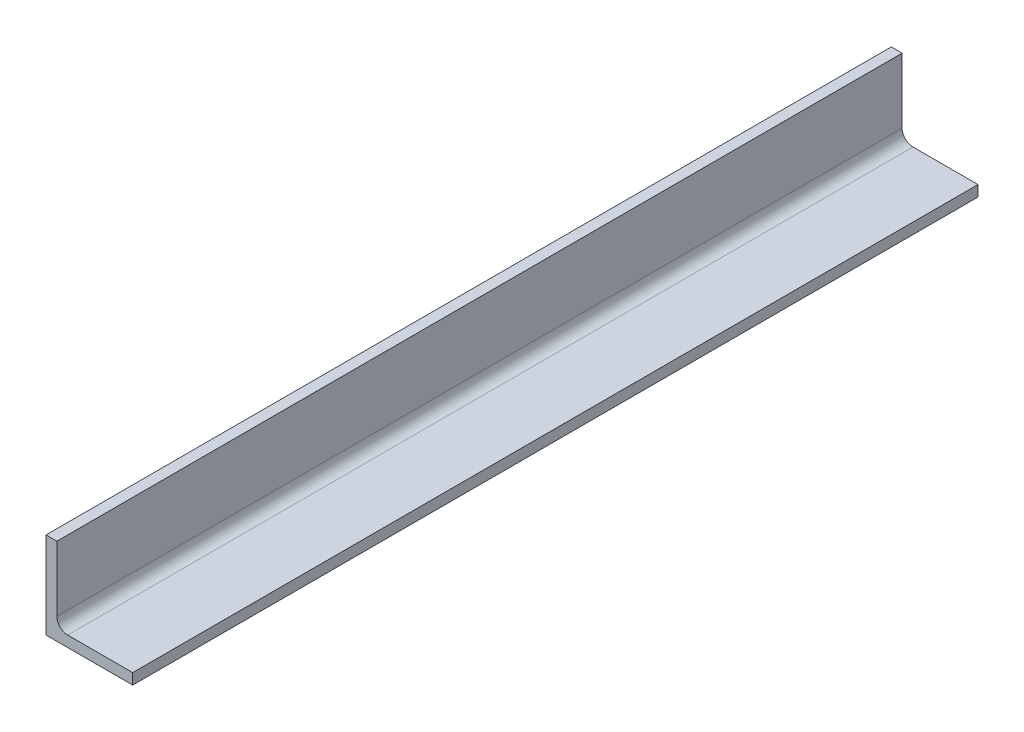
ISO-10303-21;
HEADER;
FILE_DESCRIPTION(('STEP AP214'),'2;1');
FILE_NAME('part.step','',(''),(''),'','','');
FILE_SCHEMA(('AUTOMOTIVE_DESIGN { 1 0 10303 214 1 1 1 1 }'));
ENDSEC;
DATA;
#1=APPLICATION_CONTEXT('core data for automotive mechanical design processes');
#2=APPLICATION_PROTOCOL_DEFINITION('international standard','automotive_design',2000,#1);
#3=PRODUCT_CONTEXT('',#1,'mechanical');
#4=PRODUCT('Part','Part','',(#3));
#5=PRODUCT_RELATED_PRODUCT_CATEGORY('part','',(#4));
#6=PRODUCT_DEFINITION_FORMATION('','',#4);
#7=PRODUCT_DEFINITION_CONTEXT('part definition',#1,'design');
#8=PRODUCT_DEFINITION('design','',#6,#7);
#9=PRODUCT_DEFINITION_SHAPE('','',#8);
#10=(LENGTH_UNIT() NAMED_UNIT(*) SI_UNIT(.MILLI.,.METRE.));
#11=(NAMED_UNIT(*) PLANE_ANGLE_UNIT() SI_UNIT($,.RADIAN.));
#12=(NAMED_UNIT(*) SI_UNIT($,.STERADIAN.) SOLID_ANGLE_UNIT());
#13=UNCERTAINTY_MEASURE_WITH_UNIT(LENGTH_MEASURE(1.E-05),#10,'distance_accuracy_value','');
#14=(GEOMETRIC_REPRESENTATION_CONTEXT(3) GLOBAL_UNCERTAINTY_ASSIGNED_CONTEXT((#13)) GLOBAL_UNIT_ASSIGNED_CONTEXT((#10,
#11,#12)) REPRESENTATION_CONTEXT('',''));
#15=CARTESIAN_POINT('',(0.,0.,0.));
#16=DIRECTION('',(0.,0.,1.));
#17=DIRECTION('',(1.,0.,0.));
#18=AXIS2_PLACEMENT_3D('',#15,#16,#17);
#19=CARTESIAN_POINT('',(3.175,25.4,123.83));
#20=DIRECTION('',(0.,-1.,0.));
#21=DIRECTION('',(0.,0.,-1.));
#22=AXIS2_PLACEMENT_3D('',#19,#20,#21);
#23=PLANE('',#22);
#24=DIRECTION('',(-1.,0.,0.));
#25=VECTOR('',#24,1.);
#26=CARTESIAN_POINT('',(3.175,25.4,-123.83));
#27=LINE('',#26,#25);
#28=CARTESIAN_POINT('',(3.175,25.4,-123.83));
#29=VERTEX_POINT('',#28);
#30=CARTESIAN_POINT('',(0.,25.4,-123.83));
#31=VERTEX_POINT('',#30);
#32=EDGE_CURVE('E124',#29,#31,#27,.T.);
#33=ORIENTED_EDGE('',*,*,#32,.T.);
#34=DIRECTION('',(0.,0.,-1.));
#35=VECTOR('',#34,1.);
#36=CARTESIAN_POINT('',(0.,25.4,123.83));
#37=LINE('',#36,#35);
#38=CARTESIAN_POINT('',(0.,25.4,123.83));
#39=VERTEX_POINT('',#38);
#40=EDGE_CURVE('E105',#39,#31,#37,.T.);
#41=ORIENTED_EDGE('',*,*,#40,.F.);
#42=DIRECTION('',(-1.,0.,0.));
#43=VECTOR('',#42,1.);
#44=CARTESIAN_POINT('',(3.175,25.4,123.83));
#45=LINE('',#44,#43);
#46=CARTESIAN_POINT('',(3.175,25.4,123.83));
#47=VERTEX_POINT('',#46);
#48=EDGE_CURVE('E112',#47,#39,#45,.T.);
#49=ORIENTED_EDGE('',*,*,#48,.F.);
#50=DIRECTION('',(0.,0.,-1.));
#51=VECTOR('',#50,1.);
#52=CARTESIAN_POINT('',(3.175,25.4,123.83));
#53=LINE('',#52,#51);
#54=EDGE_CURVE('E138',#47,#29,#53,.T.);
#55=ORIENTED_EDGE('',*,*,#54,.T.);
#56=EDGE_LOOP('',(#33,#41,#49,#55));
#57=FACE_BOUND('',#56,.T.);
#58=ADVANCED_FACE('F42',(#57),#23,.F.);
#59=CARTESIAN_POINT('',(0.,25.4,123.83));
#60=DIRECTION('',(1.,0.,0.));
#61=DIRECTION('',(0.,0.,-1.));
#62=AXIS2_PLACEMENT_3D('',#59,#60,#61);
#63=PLANE('',#62);
#64=DIRECTION('',(0.,-1.,0.));
#65=VECTOR('',#64,1.);
#66=CARTESIAN_POINT('',(0.,25.4,-123.83));
#67=LINE('',#66,#65);
#68=CARTESIAN_POINT('',(0.,0.,-123.83));
#69=VERTEX_POINT('',#68);
#70=EDGE_CURVE('E147',#31,#69,#67,.T.);
#71=ORIENTED_EDGE('',*,*,#70,.T.);
#72=DIRECTION('',(0.,0.,-1.));
#73=VECTOR('',#72,1.);
#74=CARTESIAN_POINT('',(0.,0.,123.83));
#75=LINE('',#74,#73);
#76=CARTESIAN_POINT('',(0.,0.,123.83));
#77=VERTEX_POINT('',#76);
#78=EDGE_CURVE('E108',#77,#69,#75,.T.);
#79=ORIENTED_EDGE('',*,*,#78,.F.);
#80=DIRECTION('',(0.,-1.,0.));
#81=VECTOR('',#80,1.);
#82=CARTESIAN_POINT('',(0.,25.4,123.83));
#83=LINE('',#82,#81);
#84=EDGE_CURVE('E101',#39,#77,#83,.T.);
#85=ORIENTED_EDGE('',*,*,#84,.F.);
#86=ORIENTED_EDGE('',*,*,#40,.T.);
#87=EDGE_LOOP('',(#71,#79,#85,#86));
#88=FACE_BOUND('',#87,.T.);
#89=ADVANCED_FACE('F103',(#88),#63,.F.);
#90=CARTESIAN_POINT('',(0.,0.,123.83));
#91=DIRECTION('',(0.,1.,0.));
#92=DIRECTION('',(0.,0.,1.));
#93=AXIS2_PLACEMENT_3D('',#90,#91,#92);
#94=PLANE('',#93);
#95=DIRECTION('',(1.,0.,0.));
#96=VECTOR('',#95,1.);
#97=CARTESIAN_POINT('',(0.,0.,-123.83));
#98=LINE('',#97,#96);
#99=CARTESIAN_POINT('',(25.4,0.,-123.83));
#100=VERTEX_POINT('',#99);
#101=EDGE_CURVE('E145',#69,#100,#98,.T.);
#102=ORIENTED_EDGE('',*,*,#101,.T.);
#103=DIRECTION('',(0.,0.,-1.));
#104=VECTOR('',#103,1.);
#105=CARTESIAN_POINT('',(25.4,0.,123.83));
#106=LINE('',#105,#104);
#107=CARTESIAN_POINT('',(25.4,0.,123.83));
#108=VERTEX_POINT('',#107);
#109=EDGE_CURVE('E129',#108,#100,#106,.T.);
#110=ORIENTED_EDGE('',*,*,#109,.F.);
#111=DIRECTION('',(1.,0.,0.));
#112=VECTOR('',#111,1.);
#113=CARTESIAN_POINT('',(0.,0.,123.83));
#114=LINE('',#113,#112);
#115=EDGE_CURVE('E111',#77,#108,#114,.T.);
#116=ORIENTED_EDGE('',*,*,#115,.F.);
#117=ORIENTED_EDGE('',*,*,#78,.T.);
#118=EDGE_LOOP('',(#102,#110,#116,#117));
#119=FACE_BOUND('',#118,.T.);
#120=ADVANCED_FACE('F159',(#119),#94,.F.);
#121=CARTESIAN_POINT('',(25.4,0.,123.83));
#122=DIRECTION('',(-1.,0.,0.));
#123=DIRECTION('',(0.,0.,1.));
#124=AXIS2_PLACEMENT_3D('',#121,#122,#123);
#125=PLANE('',#124);
#126=DIRECTION('',(0.,1.,0.));
#127=VECTOR('',#126,1.);
#128=CARTESIAN_POINT('',(25.4,0.,-123.83));
#129=LINE('',#128,#127);
#130=CARTESIAN_POINT('',(25.4,3.175,-123.83));
#131=VERTEX_POINT('',#130);
#132=EDGE_CURVE('E143',#100,#131,#129,.T.);
#133=ORIENTED_EDGE('',*,*,#132,.T.);
#134=DIRECTION('',(0.,0.,-1.));
#135=VECTOR('',#134,1.);
#136=CARTESIAN_POINT('',(25.4,3.175,123.83));
#137=LINE('',#136,#135);
#138=CARTESIAN_POINT('',(25.4,3.175,123.83));
#139=VERTEX_POINT('',#138);
#140=EDGE_CURVE('E135',#139,#131,#137,.T.);
#141=ORIENTED_EDGE('',*,*,#140,.F.);
#142=DIRECTION('',(0.,1.,0.));
#143=VECTOR('',#142,1.);
#144=CARTESIAN_POINT('',(25.4,0.,123.83));
#145=LINE('',#144,#143);
#146=EDGE_CURVE('E153',#108,#139,#145,.T.);
#147=ORIENTED_EDGE('',*,*,#146,.F.);
#148=ORIENTED_EDGE('',*,*,#109,.T.);
#149=EDGE_LOOP('',(#133,#141,#147,#148));
#150=FACE_BOUND('',#149,.T.);
#151=ADVANCED_FACE('F163',(#150),#125,.F.);
#152=CARTESIAN_POINT('',(25.4,3.175,123.83));
#153=DIRECTION('',(0.,-1.,0.));
#154=DIRECTION('',(0.,0.,-1.));
#155=AXIS2_PLACEMENT_3D('',#152,#153,#154);
#156=PLANE('',#155);
#157=DIRECTION('',(-1.,0.,0.));
#158=VECTOR('',#157,1.);
#159=CARTESIAN_POINT('',(25.4,3.175,-123.83));
#160=LINE('',#159,#158);
#161=CARTESIAN_POINT('',(6.35,3.175,-123.83));
#162=VERTEX_POINT('',#161);
#163=EDGE_CURVE('E141',#131,#162,#160,.T.);
#164=ORIENTED_EDGE('',*,*,#163,.T.);
#165=DIRECTION('',(0.,0.,-1.));
#166=VECTOR('',#165,1.);
#167=CARTESIAN_POINT('',(6.35,3.175,123.83));
#168=LINE('',#167,#166);
#169=CARTESIAN_POINT('',(6.35,3.175,123.83));
#170=VERTEX_POINT('',#169);
#171=EDGE_CURVE('E57',#162,#170,#168,.F.);
#172=ORIENTED_EDGE('',*,*,#171,.T.);
#173=DIRECTION('',(-1.,0.,0.));
#174=VECTOR('',#173,1.);
#175=CARTESIAN_POINT('',(25.4,3.175,123.83));
#176=LINE('',#175,#174);
#177=EDGE_CURVE('E151',#139,#170,#176,.T.);
#178=ORIENTED_EDGE('',*,*,#177,.F.);
#179=ORIENTED_EDGE('',*,*,#140,.T.);
#180=EDGE_LOOP('',(#164,#172,#178,#179));
#181=FACE_BOUND('',#180,.T.);
#182=ADVANCED_FACE('F164',(#181),#156,.F.);
#183=CARTESIAN_POINT('',(3.175,3.175,123.83));
#184=DIRECTION('',(-1.,0.,0.));
#185=DIRECTION('',(0.,0.,1.));
#186=AXIS2_PLACEMENT_3D('',#183,#184,#185);
#187=PLANE('',#186);
#188=DIRECTION('',(0.,1.,0.));
#189=VECTOR('',#188,1.);
#190=CARTESIAN_POINT('',(3.175,3.175,123.83));
#191=LINE('',#190,#189);
#192=CARTESIAN_POINT('',(3.175,6.35,123.83));
#193=VERTEX_POINT('',#192);
#194=EDGE_CURVE('E117',#193,#47,#191,.T.);
#195=ORIENTED_EDGE('',*,*,#194,.F.);
#196=DIRECTION('',(0.,0.,-1.));
#197=VECTOR('',#196,1.);
#198=CARTESIAN_POINT('',(3.175,6.35,-123.83));
#199=LINE('',#198,#197);
#200=CARTESIAN_POINT('',(3.175,6.35,-123.83));
#201=VERTEX_POINT('',#200);
#202=EDGE_CURVE('E125',#193,#201,#199,.T.);
#203=ORIENTED_EDGE('',*,*,#202,.T.);
#204=DIRECTION('',(0.,1.,0.));
#205=VECTOR('',#204,1.);
#206=CARTESIAN_POINT('',(3.175,3.175,-123.83));
#207=LINE('',#206,#205);
#208=EDGE_CURVE('E121',#201,#29,#207,.T.);
#209=ORIENTED_EDGE('',*,*,#208,.T.);
#210=ORIENTED_EDGE('',*,*,#54,.F.);
#211=EDGE_LOOP('',(#195,#203,#209,#210));
#212=FACE_BOUND('',#211,.T.);
#213=ADVANCED_FACE('F169',(#212),#187,.F.);
#214=CARTESIAN_POINT('',(0.,0.,123.83));
#215=DIRECTION('',(0.,0.,1.));
#216=DIRECTION('',(1.,0.,0.));
#217=AXIS2_PLACEMENT_3D('',#214,#215,#216);
#218=PLANE('',#217);
#219=ORIENTED_EDGE('',*,*,#48,.T.);
#220=ORIENTED_EDGE('',*,*,#84,.T.);
#221=ORIENTED_EDGE('',*,*,#115,.T.);
#222=ORIENTED_EDGE('',*,*,#146,.T.);
#223=ORIENTED_EDGE('',*,*,#177,.T.);
#224=CARTESIAN_POINT('',(6.35,6.35,123.83));
#225=DIRECTION('',(0.,0.,1.));
#226=DIRECTION('',(1.,0.,0.));
#227=AXIS2_PLACEMENT_3D('',#224,#225,#226);
#228=CIRCLE('',#227,3.175);
#229=EDGE_CURVE('E11',#170,#193,#228,.F.);
#230=ORIENTED_EDGE('',*,*,#229,.T.);
#231=ORIENTED_EDGE('',*,*,#194,.T.);
#232=EDGE_LOOP('',(#219,#220,#221,#222,#223,#230,#231));
#233=FACE_BOUND('',#232,.T.);
#234=ADVANCED_FACE('F115',(#233),#218,.T.);
#235=CARTESIAN_POINT('',(0.,0.,-123.83));
#236=DIRECTION('',(0.,0.,1.));
#237=DIRECTION('',(1.,0.,0.));
#238=AXIS2_PLACEMENT_3D('',#235,#236,#237);
#239=PLANE('',#238);
#240=ORIENTED_EDGE('',*,*,#32,.F.);
#241=ORIENTED_EDGE('',*,*,#208,.F.);
#242=CARTESIAN_POINT('',(6.35,6.35,-123.83));
#243=DIRECTION('',(0.,0.,1.));
#244=DIRECTION('',(1.,0.,0.));
#245=AXIS2_PLACEMENT_3D('',#242,#243,#244);
#246=CIRCLE('',#245,3.175);
#247=EDGE_CURVE('E50',#201,#162,#246,.T.);
#248=ORIENTED_EDGE('',*,*,#247,.T.);
#249=ORIENTED_EDGE('',*,*,#163,.F.);
#250=ORIENTED_EDGE('',*,*,#132,.F.);
#251=ORIENTED_EDGE('',*,*,#101,.F.);
#252=ORIENTED_EDGE('',*,*,#70,.F.);
#253=EDGE_LOOP('',(#240,#241,#248,#249,#250,#251,#252));
#254=FACE_BOUND('',#253,.T.);
#255=ADVANCED_FACE('F170',(#254),#239,.F.);
#256=CARTESIAN_POINT('',(6.35,6.35,123.83));
#257=DIRECTION('',(0.,0.,1.));
#258=DIRECTION('',(1.,0.,0.));
#259=AXIS2_PLACEMENT_3D('',#256,#257,#258);
#260=CYLINDRICAL_SURFACE('',#259,3.175);
#261=ORIENTED_EDGE('',*,*,#229,.F.);
#262=ORIENTED_EDGE('',*,*,#171,.F.);
#263=ORIENTED_EDGE('',*,*,#247,.F.);
#264=ORIENTED_EDGE('',*,*,#202,.F.);
#265=EDGE_LOOP('',(#261,#262,#263,#264));
#266=FACE_BOUND('',#265,.T.);
#267=ADVANCED_FACE('F44',(#266),#260,.F.);
#268=CLOSED_SHELL('',(#58,#89,#120,#151,#182,#213,#234,#255,#267));
#269=MANIFOLD_SOLID_BREP('B2',#268);
#270=ADVANCED_BREP_SHAPE_REPRESENTATION('',(#18,#269),#14);
#271=SHAPE_DEFINITION_REPRESENTATION(#9,#270);
ENDSEC;
END-ISO-10303-21;
